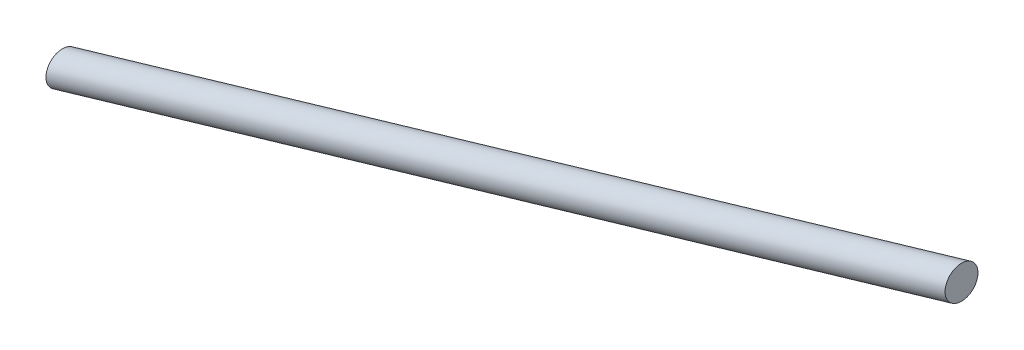
ISO-10303-21;
HEADER;
FILE_DESCRIPTION(('STEP AP214'),'2;1');
FILE_NAME('part.step','',(''),(''),'','','');
FILE_SCHEMA(('AUTOMOTIVE_DESIGN { 1 0 10303 214 1 1 1 1 }'));
ENDSEC;
DATA;
#1=APPLICATION_CONTEXT('core data for automotive mechanical design processes');
#2=APPLICATION_PROTOCOL_DEFINITION('international standard','automotive_design',2000,#1);
#3=PRODUCT_CONTEXT('',#1,'mechanical');
#4=PRODUCT('Part','Part','',(#3));
#5=PRODUCT_RELATED_PRODUCT_CATEGORY('part','',(#4));
#6=PRODUCT_DEFINITION_FORMATION('','',#4);
#7=PRODUCT_DEFINITION_CONTEXT('part definition',#1,'design');
#8=PRODUCT_DEFINITION('design','',#6,#7);
#9=PRODUCT_DEFINITION_SHAPE('','',#8);
#10=(LENGTH_UNIT() NAMED_UNIT(*) SI_UNIT(.MILLI.,.METRE.));
#11=(NAMED_UNIT(*) PLANE_ANGLE_UNIT() SI_UNIT($,.RADIAN.));
#12=(NAMED_UNIT(*) SI_UNIT($,.STERADIAN.) SOLID_ANGLE_UNIT());
#13=UNCERTAINTY_MEASURE_WITH_UNIT(LENGTH_MEASURE(1.E-05),#10,'distance_accuracy_value','');
#14=(GEOMETRIC_REPRESENTATION_CONTEXT(3) GLOBAL_UNCERTAINTY_ASSIGNED_CONTEXT((#13)) GLOBAL_UNIT_ASSIGNED_CONTEXT((#10,
#11,#12)) REPRESENTATION_CONTEXT('',''));
#15=CARTESIAN_POINT('',(0.,0.,0.));
#16=DIRECTION('',(0.,0.,1.));
#17=DIRECTION('',(1.,0.,0.));
#18=AXIS2_PLACEMENT_3D('',#15,#16,#17);
#19=CARTESIAN_POINT('',(1038.76118749577,304.771008556217,0.));
#20=DIRECTION('',(1.,0.,0.));
#21=DIRECTION('',(0.,0.,-1.));
#22=AXIS2_PLACEMENT_3D('',#19,#20,#21);
#23=CIRCLE('',#22,19.05);
#24=DIRECTION('',(-0.959552082213234,-0.281531173265497,0.));
#25=VECTOR('',#24,1.);
#26=SURFACE_OF_LINEAR_EXTRUSION('',#23,#25);
#27=CARTESIAN_POINT('',(1038.76118749577,304.771008556217,-19.05));
#28=VERTEX_POINT('',#27);
#29=EDGE_CURVE('E10',#28,#28,#23,.T.);
#30=ORIENTED_EDGE('',*,*,#29,.F.);
#31=EDGE_LOOP('',(#30));
#32=FACE_BOUND('',#31,.T.);
#33=CARTESIAN_POINT('',(0.,0.,0.));
#34=DIRECTION('',(1.,0.,0.));
#35=DIRECTION('',(0.,0.,-1.));
#36=AXIS2_PLACEMENT_3D('',#33,#34,#35);
#37=CIRCLE('',#36,19.05);
#38=CARTESIAN_POINT('',(0.,0.,-19.05));
#39=VERTEX_POINT('',#38);
#40=EDGE_CURVE('E47',#39,#39,#37,.T.);
#41=ORIENTED_EDGE('',*,*,#40,.T.);
#42=EDGE_LOOP('',(#41));
#43=FACE_BOUND('',#42,.T.);
#44=ADVANCED_FACE('F43',(#32,#43),#26,.F.);
#45=CARTESIAN_POINT('',(1038.76118749577,304.771008556217,0.));
#46=DIRECTION('',(1.,0.,0.));
#47=DIRECTION('',(0.,0.,-1.));
#48=AXIS2_PLACEMENT_3D('',#45,#46,#47);
#49=PLANE('',#48);
#50=ORIENTED_EDGE('',*,*,#29,.T.);
#51=EDGE_LOOP('',(#50));
#52=FACE_BOUND('',#51,.T.);
#53=ADVANCED_FACE('F61',(#52),#49,.T.);
#54=CARTESIAN_POINT('',(0.,0.,0.));
#55=DIRECTION('',(1.,0.,0.));
#56=DIRECTION('',(0.,0.,-1.));
#57=AXIS2_PLACEMENT_3D('',#54,#55,#56);
#58=PLANE('',#57);
#59=ORIENTED_EDGE('',*,*,#40,.F.);
#60=EDGE_LOOP('',(#59));
#61=FACE_BOUND('',#60,.T.);
#62=ADVANCED_FACE('F59',(#61),#58,.F.);
#63=CLOSED_SHELL('',(#44,#53,#62));
#64=MANIFOLD_SOLID_BREP('B2',#63);
#65=ADVANCED_BREP_SHAPE_REPRESENTATION('',(#18,#64),#14);
#66=SHAPE_DEFINITION_REPRESENTATION(#9,#65);
ENDSEC;
END-ISO-10303-21;
